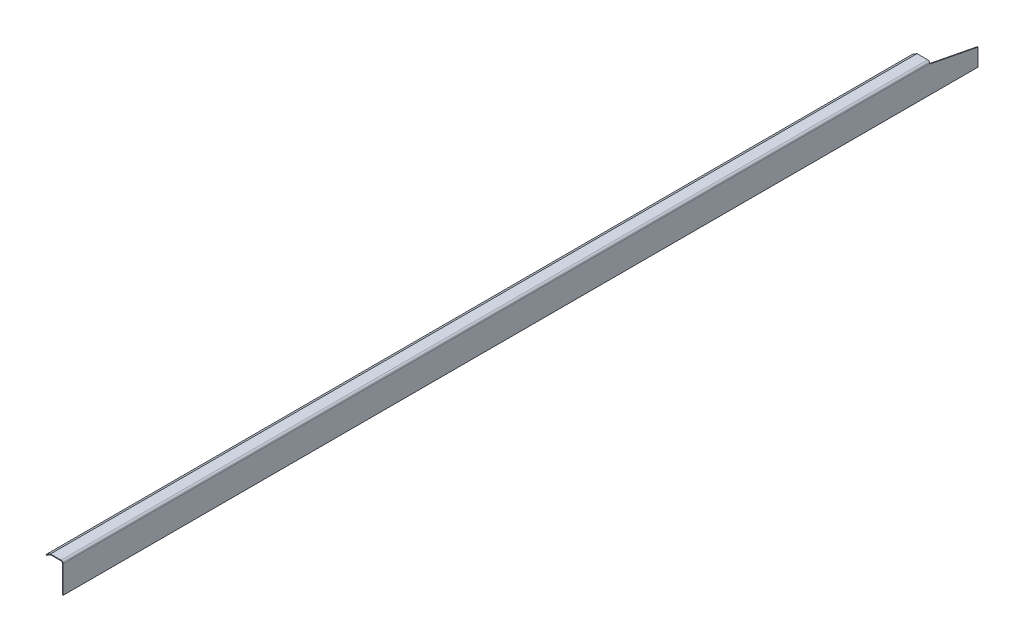
ISO-10303-21;
HEADER;
FILE_DESCRIPTION(('STEP AP214'),'2;1');
FILE_NAME('part.step','',(''),(''),'','','');
FILE_SCHEMA(('AUTOMOTIVE_DESIGN { 1 0 10303 214 1 1 1 1 }'));
ENDSEC;
DATA;
#1=APPLICATION_CONTEXT('core data for automotive mechanical design processes');
#2=APPLICATION_PROTOCOL_DEFINITION('international standard','automotive_design',2000,#1);
#3=PRODUCT_CONTEXT('',#1,'mechanical');
#4=PRODUCT('Part','Part','',(#3));
#5=PRODUCT_RELATED_PRODUCT_CATEGORY('part','',(#4));
#6=PRODUCT_DEFINITION_FORMATION('','',#4);
#7=PRODUCT_DEFINITION_CONTEXT('part definition',#1,'design');
#8=PRODUCT_DEFINITION('design','',#6,#7);
#9=PRODUCT_DEFINITION_SHAPE('','',#8);
#10=(LENGTH_UNIT() NAMED_UNIT(*) SI_UNIT(.MILLI.,.METRE.));
#11=(NAMED_UNIT(*) PLANE_ANGLE_UNIT() SI_UNIT($,.RADIAN.));
#12=(NAMED_UNIT(*) SI_UNIT($,.STERADIAN.) SOLID_ANGLE_UNIT());
#13=UNCERTAINTY_MEASURE_WITH_UNIT(LENGTH_MEASURE(1.E-05),#10,'distance_accuracy_value','');
#14=(GEOMETRIC_REPRESENTATION_CONTEXT(3) GLOBAL_UNCERTAINTY_ASSIGNED_CONTEXT((#13)) GLOBAL_UNIT_ASSIGNED_CONTEXT((#10,
#11,#12)) REPRESENTATION_CONTEXT('',''));
#15=CARTESIAN_POINT('',(0.,0.,0.));
#16=DIRECTION('',(0.,0.,1.));
#17=DIRECTION('',(1.,0.,0.));
#18=AXIS2_PLACEMENT_3D('',#15,#16,#17);
#19=CARTESIAN_POINT('',(1143.,32.54375,542.13125));
#20=DIRECTION('',(-1.,0.,0.));
#21=DIRECTION('',(0.,0.,1.));
#22=AXIS2_PLACEMENT_3D('',#19,#20,#21);
#23=PLANE('',#22);
#24=DIRECTION('',(0.,1.,0.));
#25=VECTOR('',#24,1.);
#26=CARTESIAN_POINT('',(1143.,32.54375,-542.13125));
#27=LINE('',#26,#25);
#28=CARTESIAN_POINT('',(1143.,0.,-542.13125));
#29=VERTEX_POINT('',#28);
#30=CARTESIAN_POINT('',(1143.,20.6502,-542.13125));
#31=VERTEX_POINT('',#30);
#32=EDGE_CURVE('E128',#29,#31,#27,.T.);
#33=ORIENTED_EDGE('',*,*,#32,.T.);
#34=DIRECTION('',(0.,-0.190659456215486,-0.981656239095752));
#35=VECTOR('',#34,1.);
#36=CARTESIAN_POINT('',(1143.,31.75,-484.98125));
#37=LINE('',#36,#35);
#38=CARTESIAN_POINT('',(1143.,31.75,-484.98125));
#39=VERTEX_POINT('',#38);
#40=EDGE_CURVE('E45',#39,#31,#37,.T.);
#41=ORIENTED_EDGE('',*,*,#40,.F.);
#42=DIRECTION('',(0.,-1.,0.));
#43=VECTOR('',#42,1.);
#44=CARTESIAN_POINT('',(1143.,34.925,-484.98125));
#45=LINE('',#44,#43);
#46=CARTESIAN_POINT('',(1143.,32.54375,-484.98125));
#47=VERTEX_POINT('',#46);
#48=EDGE_CURVE('E324',#47,#39,#45,.T.);
#49=ORIENTED_EDGE('',*,*,#48,.F.);
#50=DIRECTION('',(0.,0.,-1.));
#51=VECTOR('',#50,1.);
#52=CARTESIAN_POINT('',(1143.,32.54375,542.13125));
#53=LINE('',#52,#51);
#54=CARTESIAN_POINT('',(1143.,32.54375,542.13125));
#55=VERTEX_POINT('',#54);
#56=EDGE_CURVE('E154',#55,#47,#53,.T.);
#57=ORIENTED_EDGE('',*,*,#56,.F.);
#58=DIRECTION('',(0.,1.,0.));
#59=VECTOR('',#58,1.);
#60=CARTESIAN_POINT('',(1143.,32.54375,542.13125));
#61=LINE('',#60,#59);
#62=CARTESIAN_POINT('',(1143.,0.,542.13125));
#63=VERTEX_POINT('',#62);
#64=EDGE_CURVE('E135',#63,#55,#61,.T.);
#65=ORIENTED_EDGE('',*,*,#64,.F.);
#66=DIRECTION('',(0.,0.,-1.));
#67=VECTOR('',#66,1.);
#68=CARTESIAN_POINT('',(1143.,0.,542.13125));
#69=LINE('',#68,#67);
#70=EDGE_CURVE('E124',#63,#29,#69,.T.);
#71=ORIENTED_EDGE('',*,*,#70,.T.);
#72=EDGE_LOOP('',(#33,#41,#49,#57,#65,#71));
#73=FACE_BOUND('',#72,.T.);
#74=ADVANCED_FACE('F31',(#73),#23,.F.);
#75=CARTESIAN_POINT('',(1140.61875,32.54375,542.13125));
#76=DIRECTION('',(0.,0.,-1.));
#77=DIRECTION('',(-1.,0.,0.));
#78=AXIS2_PLACEMENT_3D('',#75,#76,#77);
#79=CYLINDRICAL_SURFACE('',#78,2.38125);
#80=ORIENTED_EDGE('',*,*,#56,.T.);
#81=CARTESIAN_POINT('',(1140.61875,32.54375,-484.98125));
#82=DIRECTION('',(0.,0.,1.));
#83=DIRECTION('',(1.,0.,0.));
#84=AXIS2_PLACEMENT_3D('',#81,#82,#83);
#85=CIRCLE('',#84,2.38125);
#86=CARTESIAN_POINT('',(1140.61875,34.925,-484.98125));
#87=VERTEX_POINT('',#86);
#88=EDGE_CURVE('E132',#47,#87,#85,.T.);
#89=ORIENTED_EDGE('',*,*,#88,.T.);
#90=DIRECTION('',(0.,0.,-1.));
#91=VECTOR('',#90,1.);
#92=CARTESIAN_POINT('',(1140.61875,34.925,542.13125));
#93=LINE('',#92,#91);
#94=CARTESIAN_POINT('',(1140.61875,34.925,542.13125));
#95=VERTEX_POINT('',#94);
#96=EDGE_CURVE('E151',#95,#87,#93,.T.);
#97=ORIENTED_EDGE('',*,*,#96,.F.);
#98=CARTESIAN_POINT('',(1140.61875,32.54375,542.13125));
#99=DIRECTION('',(0.,0.,1.));
#100=DIRECTION('',(1.,0.,0.));
#101=AXIS2_PLACEMENT_3D('',#98,#99,#100);
#102=CIRCLE('',#101,2.38125);
#103=EDGE_CURVE('E78',#55,#95,#102,.T.);
#104=ORIENTED_EDGE('',*,*,#103,.F.);
#105=EDGE_LOOP('',(#80,#89,#97,#104));
#106=FACE_BOUND('',#105,.T.);
#107=ADVANCED_FACE('F178',(#106),#79,.T.);
#108=CARTESIAN_POINT('',(1127.91875,34.925,542.13125));
#109=DIRECTION('',(0.,-1.,0.));
#110=DIRECTION('',(0.,0.,-1.));
#111=AXIS2_PLACEMENT_3D('',#108,#109,#110);
#112=PLANE('',#111);
#113=ORIENTED_EDGE('',*,*,#96,.T.);
#114=DIRECTION('',(1.,0.,0.));
#115=VECTOR('',#114,1.);
#116=CARTESIAN_POINT('',(1117.6,34.925,-484.98125));
#117=LINE('',#116,#115);
#118=CARTESIAN_POINT('',(1127.91875,34.925,-484.98125));
#119=VERTEX_POINT('',#118);
#120=EDGE_CURVE('E278',#119,#87,#117,.T.);
#121=ORIENTED_EDGE('',*,*,#120,.F.);
#122=DIRECTION('',(0.,0.,-1.));
#123=VECTOR('',#122,1.);
#124=CARTESIAN_POINT('',(1127.91875,34.925,542.13125));
#125=LINE('',#124,#123);
#126=CARTESIAN_POINT('',(1127.91875,34.925,542.13125));
#127=VERTEX_POINT('',#126);
#128=EDGE_CURVE('E148',#127,#119,#125,.T.);
#129=ORIENTED_EDGE('',*,*,#128,.F.);
#130=DIRECTION('',(-1.,0.,0.));
#131=VECTOR('',#130,1.);
#132=CARTESIAN_POINT('',(1127.91875,34.925,542.13125));
#133=LINE('',#132,#131);
#134=EDGE_CURVE('E297',#95,#127,#133,.T.);
#135=ORIENTED_EDGE('',*,*,#134,.F.);
#136=EDGE_LOOP('',(#113,#121,#129,#135));
#137=FACE_BOUND('',#136,.T.);
#138=ADVANCED_FACE('F182',(#137),#112,.F.);
#139=CARTESIAN_POINT('',(1127.91875,34.925,542.13125));
#140=DIRECTION('',(0.518301716093363,-0.855197831554007,0.));
#141=DIRECTION('',(0.855197831554007,0.518301716093363,0.));
#142=AXIS2_PLACEMENT_3D('',#139,#140,#141);
#143=PLANE('',#142);
#144=ORIENTED_EDGE('',*,*,#128,.T.);
#145=DIRECTION('',(-0.855197831554007,-0.518301716093363,0.));
#146=VECTOR('',#145,1.);
#147=CARTESIAN_POINT('',(1127.91875,34.925,-484.98125));
#148=LINE('',#147,#146);
#149=CARTESIAN_POINT('',(1122.68,31.75,-484.98125));
#150=VERTEX_POINT('',#149);
#151=EDGE_CURVE('E274',#119,#150,#148,.T.);
#152=ORIENTED_EDGE('',*,*,#151,.T.);
#153=DIRECTION('',(0.,0.,-1.));
#154=VECTOR('',#153,1.);
#155=CARTESIAN_POINT('',(1122.68,31.75,542.13125));
#156=LINE('',#155,#154);
#157=CARTESIAN_POINT('',(1122.68,31.75,542.13125));
#158=VERTEX_POINT('',#157);
#159=EDGE_CURVE('E145',#158,#150,#156,.T.);
#160=ORIENTED_EDGE('',*,*,#159,.F.);
#161=DIRECTION('',(-0.855197831554007,-0.518301716093363,0.));
#162=VECTOR('',#161,1.);
#163=CARTESIAN_POINT('',(1127.91875,34.925,542.13125));
#164=LINE('',#163,#162);
#165=EDGE_CURVE('E294',#127,#158,#164,.T.);
#166=ORIENTED_EDGE('',*,*,#165,.F.);
#167=EDGE_LOOP('',(#144,#152,#160,#166));
#168=FACE_BOUND('',#167,.T.);
#169=ADVANCED_FACE('F186',(#168),#143,.F.);
#170=CARTESIAN_POINT('',(1122.68,31.75,542.13125));
#171=DIRECTION('',(0.855197831640066,0.518301715951366,0.));
#172=DIRECTION('',(-0.518301715951366,0.855197831640066,0.));
#173=AXIS2_PLACEMENT_3D('',#170,#171,#172);
#174=PLANE('',#173);
#175=ORIENTED_EDGE('',*,*,#159,.T.);
#176=DIRECTION('',(-0.518301716093394,0.855197831553988,0.));
#177=VECTOR('',#176,1.);
#178=CARTESIAN_POINT('',(1122.68,31.75,-484.98125));
#179=LINE('',#178,#177);
#180=CARTESIAN_POINT('',(1123.09140198655,31.0711867221883,-484.98125));
#181=VERTEX_POINT('',#180);
#182=EDGE_CURVE('E283',#181,#150,#179,.T.);
#183=ORIENTED_EDGE('',*,*,#182,.F.);
#184=DIRECTION('',(0.,0.,-1.));
#185=VECTOR('',#184,1.);
#186=CARTESIAN_POINT('',(1123.09140198644,31.07118672212,542.13125));
#187=LINE('',#186,#185);
#188=CARTESIAN_POINT('',(1123.09140198644,31.07118672212,542.13125));
#189=VERTEX_POINT('',#188);
#190=EDGE_CURVE('E142',#189,#181,#187,.T.);
#191=ORIENTED_EDGE('',*,*,#190,.F.);
#192=DIRECTION('',(0.518301715951366,-0.855197831640066,0.));
#193=VECTOR('',#192,1.);
#194=CARTESIAN_POINT('',(1122.68,31.75,542.13125));
#195=LINE('',#194,#193);
#196=EDGE_CURVE('E296',#158,#189,#195,.T.);
#197=ORIENTED_EDGE('',*,*,#196,.F.);
#198=EDGE_LOOP('',(#175,#183,#191,#197));
#199=FACE_BOUND('',#198,.T.);
#200=ADVANCED_FACE('F192',(#199),#174,.F.);
#201=CARTESIAN_POINT('',(1123.09140198644,31.07118672212,542.13125));
#202=DIRECTION('',(-0.518301715959872,0.85519783163491,0.));
#203=DIRECTION('',(-0.85519783163491,-0.518301715959872,0.));
#204=AXIS2_PLACEMENT_3D('',#201,#202,#203);
#205=PLANE('',#204);
#206=ORIENTED_EDGE('',*,*,#190,.T.);
#207=DIRECTION('',(0.85519783163491,0.518301715959872,0.));
#208=VECTOR('',#207,1.);
#209=CARTESIAN_POINT('',(1123.09140198644,31.07118672212,-484.98125));
#210=LINE('',#209,#208);
#211=CARTESIAN_POINT('',(1128.14050639672,34.13125,-484.98125));
#212=VERTEX_POINT('',#211);
#213=EDGE_CURVE('E287',#181,#212,#210,.T.);
#214=ORIENTED_EDGE('',*,*,#213,.T.);
#215=DIRECTION('',(0.,0.,-1.));
#216=VECTOR('',#215,1.);
#217=CARTESIAN_POINT('',(1128.14050639672,34.13125,542.13125));
#218=LINE('',#217,#216);
#219=CARTESIAN_POINT('',(1128.14050639672,34.13125,542.13125));
#220=VERTEX_POINT('',#219);
#221=EDGE_CURVE('E139',#220,#212,#218,.T.);
#222=ORIENTED_EDGE('',*,*,#221,.F.);
#223=DIRECTION('',(0.85519783163491,0.518301715959872,0.));
#224=VECTOR('',#223,1.);
#225=CARTESIAN_POINT('',(1123.09140198644,31.07118672212,542.13125));
#226=LINE('',#225,#224);
#227=EDGE_CURVE('E299',#189,#220,#226,.T.);
#228=ORIENTED_EDGE('',*,*,#227,.F.);
#229=EDGE_LOOP('',(#206,#214,#222,#228));
#230=FACE_BOUND('',#229,.T.);
#231=ADVANCED_FACE('F196',(#230),#205,.F.);
#232=CARTESIAN_POINT('',(1140.61875,34.13125,542.13125));
#233=DIRECTION('',(0.,1.,0.));
#234=DIRECTION('',(0.,0.,1.));
#235=AXIS2_PLACEMENT_3D('',#232,#233,#234);
#236=PLANE('',#235);
#237=ORIENTED_EDGE('',*,*,#221,.T.);
#238=DIRECTION('',(1.,0.,0.));
#239=VECTOR('',#238,1.);
#240=CARTESIAN_POINT('',(1140.61875,34.13125,-484.98125));
#241=LINE('',#240,#239);
#242=CARTESIAN_POINT('',(1140.61875,34.1312499999999,-484.98125));
#243=VERTEX_POINT('',#242);
#244=EDGE_CURVE('E311',#212,#243,#241,.T.);
#245=ORIENTED_EDGE('',*,*,#244,.T.);
#246=DIRECTION('',(0.,0.,-1.));
#247=VECTOR('',#246,1.);
#248=CARTESIAN_POINT('',(1140.61875,34.1312499999999,542.13125));
#249=LINE('',#248,#247);
#250=CARTESIAN_POINT('',(1140.61875,34.1312499999999,542.13125));
#251=VERTEX_POINT('',#250);
#252=EDGE_CURVE('E119',#251,#243,#249,.T.);
#253=ORIENTED_EDGE('',*,*,#252,.F.);
#254=DIRECTION('',(1.,0.,0.));
#255=VECTOR('',#254,1.);
#256=CARTESIAN_POINT('',(1140.61875,34.13125,542.13125));
#257=LINE('',#256,#255);
#258=EDGE_CURVE('E106',#220,#251,#257,.T.);
#259=ORIENTED_EDGE('',*,*,#258,.F.);
#260=EDGE_LOOP('',(#237,#245,#253,#259));
#261=FACE_BOUND('',#260,.T.);
#262=ADVANCED_FACE('F200',(#261),#236,.F.);
#263=CARTESIAN_POINT('',(1140.61875,32.54375,542.13125));
#264=DIRECTION('',(0.,0.,-1.));
#265=DIRECTION('',(-1.,0.,0.));
#266=AXIS2_PLACEMENT_3D('',#263,#264,#265);
#267=CYLINDRICAL_SURFACE('',#266,1.58749999999993);
#268=ORIENTED_EDGE('',*,*,#252,.T.);
#269=CARTESIAN_POINT('',(1140.61875,32.54375,-484.98125));
#270=DIRECTION('',(0.,0.,1.));
#271=DIRECTION('',(1.,0.,0.));
#272=AXIS2_PLACEMENT_3D('',#269,#270,#271);
#273=CIRCLE('',#272,1.58749999999993);
#274=CARTESIAN_POINT('',(1142.20625,32.54375,-484.98125));
#275=VERTEX_POINT('',#274);
#276=EDGE_CURVE('E117',#243,#275,#273,.F.);
#277=ORIENTED_EDGE('',*,*,#276,.T.);
#278=DIRECTION('',(0.,0.,-1.));
#279=VECTOR('',#278,1.);
#280=CARTESIAN_POINT('',(1142.20625,32.54375,542.13125));
#281=LINE('',#280,#279);
#282=CARTESIAN_POINT('',(1142.20625,32.54375,542.13125));
#283=VERTEX_POINT('',#282);
#284=EDGE_CURVE('E113',#283,#275,#281,.T.);
#285=ORIENTED_EDGE('',*,*,#284,.F.);
#286=CARTESIAN_POINT('',(1140.61875,32.54375,542.13125));
#287=DIRECTION('',(0.,0.,-1.));
#288=DIRECTION('',(1.,0.,0.));
#289=AXIS2_PLACEMENT_3D('',#286,#287,#288);
#290=CIRCLE('',#289,1.58749999999993);
#291=EDGE_CURVE('E99',#251,#283,#290,.T.);
#292=ORIENTED_EDGE('',*,*,#291,.F.);
#293=EDGE_LOOP('',(#268,#277,#285,#292));
#294=FACE_BOUND('',#293,.T.);
#295=ADVANCED_FACE('F114',(#294),#267,.F.);
#296=CARTESIAN_POINT('',(1142.20625,0.,542.13125));
#297=DIRECTION('',(1.,0.,0.));
#298=DIRECTION('',(0.,0.,-1.));
#299=AXIS2_PLACEMENT_3D('',#296,#297,#298);
#300=PLANE('',#299);
#301=DIRECTION('',(0.,-1.,0.));
#302=VECTOR('',#301,1.);
#303=CARTESIAN_POINT('',(1142.20625,0.,-484.98125));
#304=LINE('',#303,#302);
#305=CARTESIAN_POINT('',(1142.20625,31.75,-484.98125));
#306=VERTEX_POINT('',#305);
#307=EDGE_CURVE('E11',#275,#306,#304,.T.);
#308=ORIENTED_EDGE('',*,*,#307,.T.);
#309=DIRECTION('',(0.,-0.190659456215486,-0.981656239095752));
#310=VECTOR('',#309,1.);
#311=CARTESIAN_POINT('',(1142.20625,222.832330527695,498.852259581954));
#312=LINE('',#311,#310);
#313=CARTESIAN_POINT('',(1142.20625,20.6502,-542.13125));
#314=VERTEX_POINT('',#313);
#315=EDGE_CURVE('E330',#306,#314,#312,.T.);
#316=ORIENTED_EDGE('',*,*,#315,.T.);
#317=DIRECTION('',(0.,-1.,0.));
#318=VECTOR('',#317,1.);
#319=CARTESIAN_POINT('',(1142.20625,0.,-542.13125));
#320=LINE('',#319,#318);
#321=CARTESIAN_POINT('',(1142.20625,0.,-542.13125));
#322=VERTEX_POINT('',#321);
#323=EDGE_CURVE('E131',#314,#322,#320,.T.);
#324=ORIENTED_EDGE('',*,*,#323,.T.);
#325=DIRECTION('',(0.,0.,-1.));
#326=VECTOR('',#325,1.);
#327=CARTESIAN_POINT('',(1142.20625,0.,542.13125));
#328=LINE('',#327,#326);
#329=CARTESIAN_POINT('',(1142.20625,0.,542.13125));
#330=VERTEX_POINT('',#329);
#331=EDGE_CURVE('E120',#330,#322,#328,.T.);
#332=ORIENTED_EDGE('',*,*,#331,.F.);
#333=DIRECTION('',(0.,-1.,0.));
#334=VECTOR('',#333,1.);
#335=CARTESIAN_POINT('',(1142.20625,0.,542.13125));
#336=LINE('',#335,#334);
#337=EDGE_CURVE('E103',#283,#330,#336,.T.);
#338=ORIENTED_EDGE('',*,*,#337,.F.);
#339=ORIENTED_EDGE('',*,*,#284,.T.);
#340=EDGE_LOOP('',(#308,#316,#324,#332,#338,#339));
#341=FACE_BOUND('',#340,.T.);
#342=ADVANCED_FACE('F122',(#341),#300,.F.);
#343=CARTESIAN_POINT('',(1143.,0.,542.13125));
#344=DIRECTION('',(0.,1.,0.));
#345=DIRECTION('',(0.,0.,1.));
#346=AXIS2_PLACEMENT_3D('',#343,#344,#345);
#347=PLANE('',#346);
#348=DIRECTION('',(1.,0.,0.));
#349=VECTOR('',#348,1.);
#350=CARTESIAN_POINT('',(1143.,0.,-542.13125));
#351=LINE('',#350,#349);
#352=EDGE_CURVE('E69',#322,#29,#351,.T.);
#353=ORIENTED_EDGE('',*,*,#352,.T.);
#354=ORIENTED_EDGE('',*,*,#70,.F.);
#355=DIRECTION('',(1.,0.,0.));
#356=VECTOR('',#355,1.);
#357=CARTESIAN_POINT('',(1143.,0.,542.13125));
#358=LINE('',#357,#356);
#359=EDGE_CURVE('E54',#330,#63,#358,.T.);
#360=ORIENTED_EDGE('',*,*,#359,.F.);
#361=ORIENTED_EDGE('',*,*,#331,.T.);
#362=EDGE_LOOP('',(#353,#354,#360,#361));
#363=FACE_BOUND('',#362,.T.);
#364=ADVANCED_FACE('F167',(#363),#347,.F.);
#365=CARTESIAN_POINT('',(1140.61875,32.54375,542.13125));
#366=DIRECTION('',(0.,0.,1.));
#367=DIRECTION('',(1.,0.,0.));
#368=AXIS2_PLACEMENT_3D('',#365,#366,#367);
#369=PLANE('',#368);
#370=ORIENTED_EDGE('',*,*,#64,.T.);
#371=ORIENTED_EDGE('',*,*,#103,.T.);
#372=ORIENTED_EDGE('',*,*,#134,.T.);
#373=ORIENTED_EDGE('',*,*,#165,.T.);
#374=ORIENTED_EDGE('',*,*,#196,.T.);
#375=ORIENTED_EDGE('',*,*,#227,.T.);
#376=ORIENTED_EDGE('',*,*,#258,.T.);
#377=ORIENTED_EDGE('',*,*,#291,.T.);
#378=ORIENTED_EDGE('',*,*,#337,.T.);
#379=ORIENTED_EDGE('',*,*,#359,.T.);
#380=EDGE_LOOP('',(#370,#371,#372,#373,#374,#375,#376,#377,#378,#379));
#381=FACE_BOUND('',#380,.T.);
#382=ADVANCED_FACE('F101',(#381),#369,.T.);
#383=CARTESIAN_POINT('',(1140.61875,32.54375,-542.13125));
#384=DIRECTION('',(0.,0.,1.));
#385=DIRECTION('',(1.,0.,0.));
#386=AXIS2_PLACEMENT_3D('',#383,#384,#385);
#387=PLANE('',#386);
#388=ORIENTED_EDGE('',*,*,#323,.F.);
#389=DIRECTION('',(1.,0.,0.));
#390=VECTOR('',#389,1.);
#391=CARTESIAN_POINT('',(1140.61875,20.6502,-542.13125));
#392=LINE('',#391,#390);
#393=EDGE_CURVE('E38',#314,#31,#392,.T.);
#394=ORIENTED_EDGE('',*,*,#393,.T.);
#395=ORIENTED_EDGE('',*,*,#32,.F.);
#396=ORIENTED_EDGE('',*,*,#352,.F.);
#397=EDGE_LOOP('',(#388,#394,#395,#396));
#398=FACE_BOUND('',#397,.T.);
#399=ADVANCED_FACE('F158',(#398),#387,.F.);
#400=CARTESIAN_POINT('',(1117.6,34.925,-484.98125));
#401=DIRECTION('',(0.,0.,1.));
#402=DIRECTION('',(1.,0.,0.));
#403=AXIS2_PLACEMENT_3D('',#400,#401,#402);
#404=PLANE('',#403);
#405=ORIENTED_EDGE('',*,*,#151,.F.);
#406=ORIENTED_EDGE('',*,*,#120,.T.);
#407=ORIENTED_EDGE('',*,*,#88,.F.);
#408=ORIENTED_EDGE('',*,*,#48,.T.);
#409=DIRECTION('',(1.,0.,0.));
#410=VECTOR('',#409,1.);
#411=CARTESIAN_POINT('',(1117.6,31.75,-484.98125));
#412=LINE('',#411,#410);
#413=EDGE_CURVE('E292',#306,#39,#412,.T.);
#414=ORIENTED_EDGE('',*,*,#413,.F.);
#415=ORIENTED_EDGE('',*,*,#307,.F.);
#416=ORIENTED_EDGE('',*,*,#276,.F.);
#417=ORIENTED_EDGE('',*,*,#244,.F.);
#418=ORIENTED_EDGE('',*,*,#213,.F.);
#419=ORIENTED_EDGE('',*,*,#182,.T.);
#420=EDGE_LOOP('',(#405,#406,#407,#408,#414,#415,#416,#417,#418,#419));
#421=FACE_BOUND('',#420,.T.);
#422=ADVANCED_FACE('F224',(#421),#404,.F.);
#423=CARTESIAN_POINT('',(1117.6,31.75,-484.98125));
#424=DIRECTION('',(0.,-0.981656239095751,0.190659456215486));
#425=DIRECTION('',(0.,-0.190659456215486,-0.981656239095752));
#426=AXIS2_PLACEMENT_3D('',#423,#424,#425);
#427=PLANE('',#426);
#428=ORIENTED_EDGE('',*,*,#413,.T.);
#429=ORIENTED_EDGE('',*,*,#40,.T.);
#430=ORIENTED_EDGE('',*,*,#393,.F.);
#431=ORIENTED_EDGE('',*,*,#315,.F.);
#432=EDGE_LOOP('',(#428,#429,#430,#431));
#433=FACE_BOUND('',#432,.T.);
#434=ADVANCED_FACE('F231',(#433),#427,.F.);
#435=CLOSED_SHELL('',(#74,#107,#138,#169,#200,#231,#262,#295,#342,#364,#382,#399,#422,#434));
#436=MANIFOLD_SOLID_BREP('B2',#435);
#437=ADVANCED_BREP_SHAPE_REPRESENTATION('',(#18,#436),#14);
#438=SHAPE_DEFINITION_REPRESENTATION(#9,#437);
ENDSEC;
END-ISO-10303-21;
